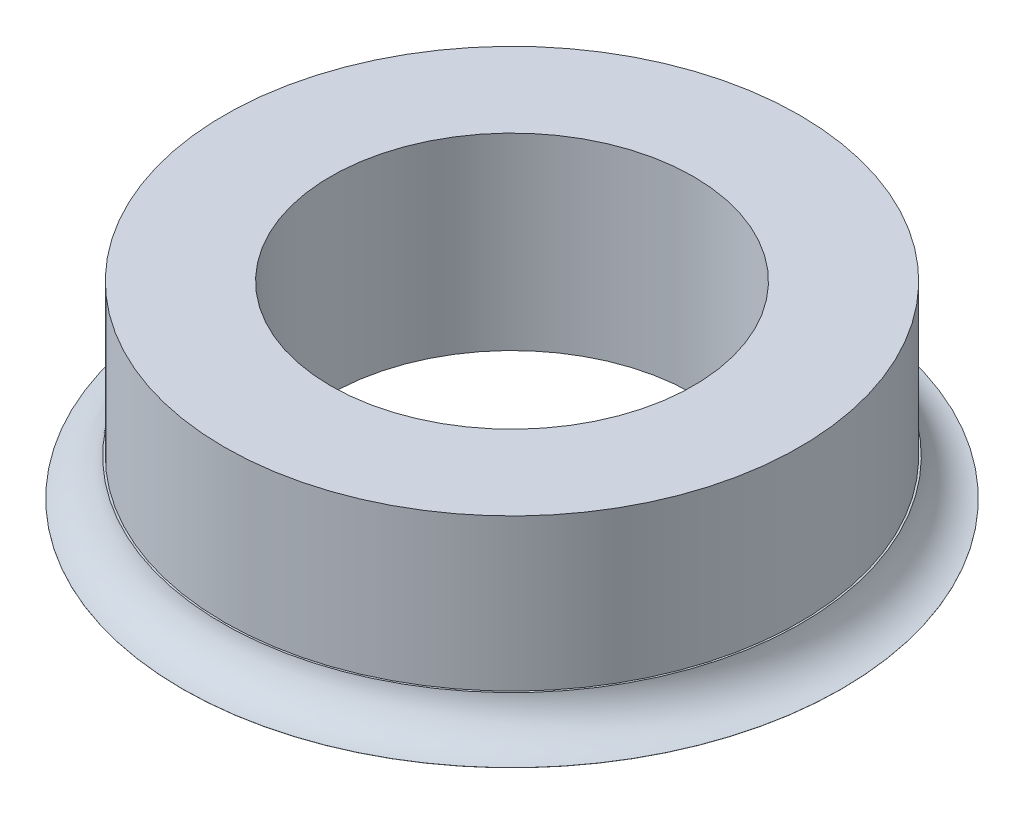
ISO-10303-21;
HEADER;
FILE_DESCRIPTION(('STEP AP214'),'2;1');
FILE_NAME('part.step','',(''),(''),'','','');
FILE_SCHEMA(('AUTOMOTIVE_DESIGN { 1 0 10303 214 1 1 1 1 }'));
ENDSEC;
DATA;
#1=APPLICATION_CONTEXT('core data for automotive mechanical design processes');
#2=APPLICATION_PROTOCOL_DEFINITION('international standard','automotive_design',2000,#1);
#3=PRODUCT_CONTEXT('',#1,'mechanical');
#4=PRODUCT('Part','Part','',(#3));
#5=PRODUCT_RELATED_PRODUCT_CATEGORY('part','',(#4));
#6=PRODUCT_DEFINITION_FORMATION('','',#4);
#7=PRODUCT_DEFINITION_CONTEXT('part definition',#1,'design');
#8=PRODUCT_DEFINITION('design','',#6,#7);
#9=PRODUCT_DEFINITION_SHAPE('','',#8);
#10=(LENGTH_UNIT() NAMED_UNIT(*) SI_UNIT(.MILLI.,.METRE.));
#11=(NAMED_UNIT(*) PLANE_ANGLE_UNIT() SI_UNIT($,.RADIAN.));
#12=(NAMED_UNIT(*) SI_UNIT($,.STERADIAN.) SOLID_ANGLE_UNIT());
#13=UNCERTAINTY_MEASURE_WITH_UNIT(LENGTH_MEASURE(1.E-05),#10,'distance_accuracy_value','');
#14=(GEOMETRIC_REPRESENTATION_CONTEXT(3) GLOBAL_UNCERTAINTY_ASSIGNED_CONTEXT((#13)) GLOBAL_UNIT_ASSIGNED_CONTEXT((#10,
#11,#12)) REPRESENTATION_CONTEXT('',''));
#15=CARTESIAN_POINT('',(0.,0.,0.));
#16=DIRECTION('',(0.,0.,1.));
#17=DIRECTION('',(1.,0.,0.));
#18=AXIS2_PLACEMENT_3D('',#15,#16,#17);
#19=CARTESIAN_POINT('',(0.,0.5,0.));
#20=DIRECTION('',(0.,-1.,0.));
#21=DIRECTION('',(0.,0.,-1.));
#22=AXIS2_PLACEMENT_3D('',#19,#20,#21);
#23=CYLINDRICAL_SURFACE('',#22,4.5);
#24=CARTESIAN_POINT('',(0.,0.,0.));
#25=DIRECTION('',(0.,-1.,0.));
#26=DIRECTION('',(0.,0.,-1.));
#27=AXIS2_PLACEMENT_3D('',#24,#25,#26);
#28=CIRCLE('',#27,4.5);
#29=CARTESIAN_POINT('',(0.,0.,-4.5));
#30=VERTEX_POINT('',#29);
#31=EDGE_CURVE('E51',#30,#30,#28,.T.);
#32=ORIENTED_EDGE('',*,*,#31,.F.);
#33=EDGE_LOOP('',(#32));
#34=FACE_BOUND('',#33,.T.);
#35=CARTESIAN_POINT('',(0.,0.0014444251859667,0.));
#36=DIRECTION('',(0.,-1.,0.));
#37=DIRECTION('',(0.,0.,-1.));
#38=AXIS2_PLACEMENT_3D('',#35,#36,#37);
#39=CIRCLE('',#38,4.5);
#40=CARTESIAN_POINT('',(0.,0.0014444251859667,-4.5));
#41=VERTEX_POINT('',#40);
#42=EDGE_CURVE('E55',#41,#41,#39,.T.);
#43=ORIENTED_EDGE('',*,*,#42,.T.);
#44=EDGE_LOOP('',(#43));
#45=FACE_BOUND('',#44,.T.);
#46=ADVANCED_FACE('F32',(#34,#45),#23,.T.);
#47=CARTESIAN_POINT('',(0.,0.5,0.));
#48=DIRECTION('',(0.,-1.,0.));
#49=DIRECTION('',(0.,0.,-1.));
#50=AXIS2_PLACEMENT_3D('',#47,#48,#49);
#51=PLANE('',#50);
#52=CARTESIAN_POINT('',(0.,0.5,0.));
#53=DIRECTION('',(0.,-1.,0.));
#54=DIRECTION('',(0.,0.,-1.));
#55=AXIS2_PLACEMENT_3D('',#52,#53,#54);
#56=CIRCLE('',#55,3.925);
#57=CARTESIAN_POINT('',(0.,0.5,-3.925));
#58=VERTEX_POINT('',#57);
#59=EDGE_CURVE('E10',#58,#58,#56,.T.);
#60=ORIENTED_EDGE('',*,*,#59,.T.);
#61=EDGE_LOOP('',(#60));
#62=FACE_BOUND('',#61,.T.);
#63=CARTESIAN_POINT('',(0.,0.5,0.));
#64=DIRECTION('',(0.,-1.,0.));
#65=DIRECTION('',(0.,0.,-1.));
#66=AXIS2_PLACEMENT_3D('',#63,#64,#65);
#67=CIRCLE('',#66,3.95);
#68=CARTESIAN_POINT('',(0.,0.5,-3.95));
#69=VERTEX_POINT('',#68);
#70=EDGE_CURVE('E58',#69,#69,#67,.T.);
#71=ORIENTED_EDGE('',*,*,#70,.F.);
#72=EDGE_LOOP('',(#71));
#73=FACE_BOUND('',#72,.T.);
#74=ADVANCED_FACE('F65',(#62,#73),#51,.F.);
#75=CARTESIAN_POINT('',(0.,2.57,0.));
#76=DIRECTION('',(0.,-1.,0.));
#77=DIRECTION('',(0.,0.,-1.));
#78=AXIS2_PLACEMENT_3D('',#75,#76,#77);
#79=CYLINDRICAL_SURFACE('',#78,3.925);
#80=CARTESIAN_POINT('',(0.,2.57,0.));
#81=DIRECTION('',(0.,1.,0.));
#82=DIRECTION('',(0.,0.,1.));
#83=AXIS2_PLACEMENT_3D('',#80,#81,#82);
#84=CIRCLE('',#83,3.925);
#85=CARTESIAN_POINT('',(0.,2.57,3.925));
#86=VERTEX_POINT('',#85);
#87=EDGE_CURVE('E39',#86,#86,#84,.T.);
#88=ORIENTED_EDGE('',*,*,#87,.F.);
#89=EDGE_LOOP('',(#88));
#90=FACE_BOUND('',#89,.T.);
#91=ORIENTED_EDGE('',*,*,#59,.F.);
#92=EDGE_LOOP('',(#91));
#93=FACE_BOUND('',#92,.T.);
#94=ADVANCED_FACE('F34',(#90,#93),#79,.T.);
#95=CARTESIAN_POINT('',(0.,2.57,0.));
#96=DIRECTION('',(0.,1.,0.));
#97=DIRECTION('',(0.,0.,1.));
#98=AXIS2_PLACEMENT_3D('',#95,#96,#97);
#99=PLANE('',#98);
#100=ORIENTED_EDGE('',*,*,#87,.T.);
#101=EDGE_LOOP('',(#100));
#102=FACE_BOUND('',#101,.T.);
#103=CARTESIAN_POINT('',(0.,2.57,0.));
#104=DIRECTION('',(0.,1.,0.));
#105=DIRECTION('',(0.,0.,1.));
#106=AXIS2_PLACEMENT_3D('',#103,#104,#105);
#107=CIRCLE('',#106,2.475);
#108=CARTESIAN_POINT('',(0.,2.57,2.475));
#109=VERTEX_POINT('',#108);
#110=EDGE_CURVE('E43',#109,#109,#107,.T.);
#111=ORIENTED_EDGE('',*,*,#110,.F.);
#112=EDGE_LOOP('',(#111));
#113=FACE_BOUND('',#112,.T.);
#114=ADVANCED_FACE('F72',(#102,#113),#99,.T.);
#115=CARTESIAN_POINT('',(0.,0.,0.));
#116=DIRECTION('',(0.,1.,0.));
#117=DIRECTION('',(0.,0.,1.));
#118=AXIS2_PLACEMENT_3D('',#115,#116,#117);
#119=PLANE('',#118);
#120=CARTESIAN_POINT('',(0.,0.,0.));
#121=DIRECTION('',(0.,1.,0.));
#122=DIRECTION('',(0.,0.,1.));
#123=AXIS2_PLACEMENT_3D('',#120,#121,#122);
#124=CIRCLE('',#123,2.475);
#125=CARTESIAN_POINT('',(0.,0.,2.475));
#126=VERTEX_POINT('',#125);
#127=EDGE_CURVE('E47',#126,#126,#124,.T.);
#128=ORIENTED_EDGE('',*,*,#127,.T.);
#129=EDGE_LOOP('',(#128));
#130=FACE_BOUND('',#129,.T.);
#131=ORIENTED_EDGE('',*,*,#31,.T.);
#132=EDGE_LOOP('',(#131));
#133=FACE_BOUND('',#132,.T.);
#134=ADVANCED_FACE('F81',(#130,#133),#119,.F.);
#135=CARTESIAN_POINT('',(0.,2.57,0.));
#136=DIRECTION('',(0.,-1.,0.));
#137=DIRECTION('',(0.,0.,-1.));
#138=AXIS2_PLACEMENT_3D('',#135,#136,#137);
#139=CYLINDRICAL_SURFACE('',#138,2.475);
#140=ORIENTED_EDGE('',*,*,#110,.T.);
#141=EDGE_LOOP('',(#140));
#142=FACE_BOUND('',#141,.T.);
#143=ORIENTED_EDGE('',*,*,#127,.F.);
#144=EDGE_LOOP('',(#143));
#145=FACE_BOUND('',#144,.T.);
#146=ADVANCED_FACE('F78',(#142,#145),#139,.F.);
#147=CARTESIAN_POINT('',(0.,0.6,0.));
#148=DIRECTION('',(0.,-1.,0.));
#149=DIRECTION('',(0.,0.,-1.));
#150=AXIS2_PLACEMENT_3D('',#147,#148,#149);
#151=TOROIDAL_SURFACE('',#150,4.54160797830996,0.6);
#152=ORIENTED_EDGE('',*,*,#70,.T.);
#153=EDGE_LOOP('',(#152));
#154=FACE_BOUND('',#153,.T.);
#155=ORIENTED_EDGE('',*,*,#42,.F.);
#156=EDGE_LOOP('',(#155));
#157=FACE_BOUND('',#156,.T.);
#158=ADVANCED_FACE('F62',(#154,#157),#151,.F.);
#159=CLOSED_SHELL('',(#46,#74,#94,#114,#134,#146,#158));
#160=MANIFOLD_SOLID_BREP('B2',#159);
#161=ADVANCED_BREP_SHAPE_REPRESENTATION('',(#18,#160),#14);
#162=SHAPE_DEFINITION_REPRESENTATION(#9,#161);
ENDSEC;
END-ISO-10303-21;
